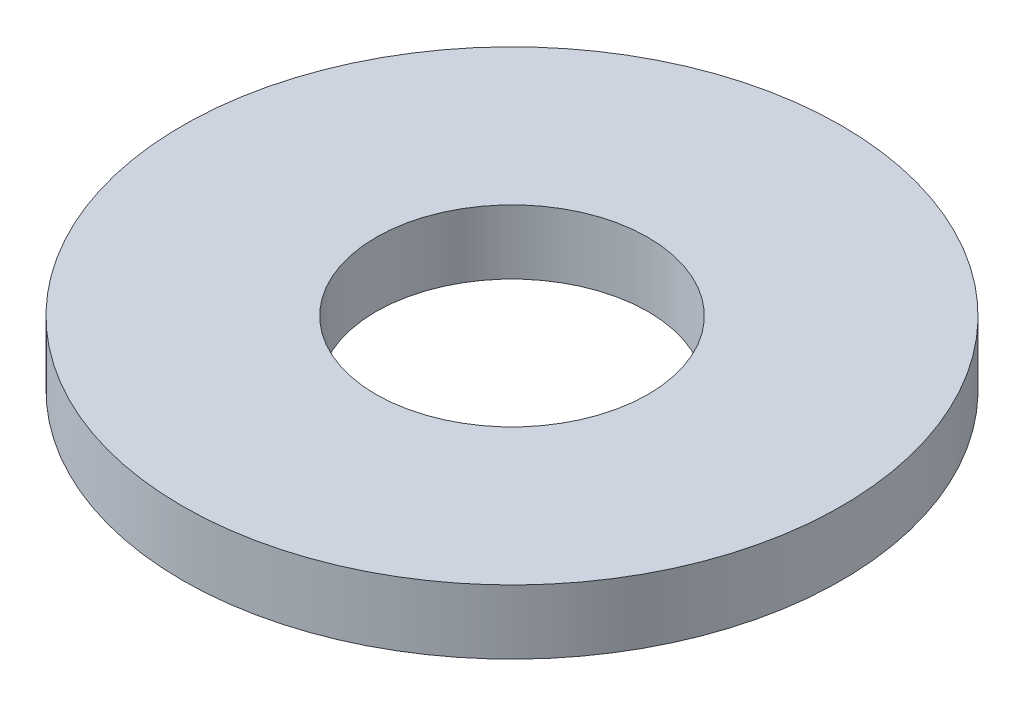
ISO-10303-21;
HEADER;
FILE_DESCRIPTION(('STEP AP214'),'2;1');
FILE_NAME('part.step','',(''),(''),'','','');
FILE_SCHEMA(('AUTOMOTIVE_DESIGN { 1 0 10303 214 1 1 1 1 }'));
ENDSEC;
DATA;
#1=APPLICATION_CONTEXT('core data for automotive mechanical design processes');
#2=APPLICATION_PROTOCOL_DEFINITION('international standard','automotive_design',2000,#1);
#3=PRODUCT_CONTEXT('',#1,'mechanical');
#4=PRODUCT('Part','Part','',(#3));
#5=PRODUCT_RELATED_PRODUCT_CATEGORY('part','',(#4));
#6=PRODUCT_DEFINITION_FORMATION('','',#4);
#7=PRODUCT_DEFINITION_CONTEXT('part definition',#1,'design');
#8=PRODUCT_DEFINITION('design','',#6,#7);
#9=PRODUCT_DEFINITION_SHAPE('','',#8);
#10=(LENGTH_UNIT() NAMED_UNIT(*) SI_UNIT(.MILLI.,.METRE.));
#11=(NAMED_UNIT(*) PLANE_ANGLE_UNIT() SI_UNIT($,.RADIAN.));
#12=(NAMED_UNIT(*) SI_UNIT($,.STERADIAN.) SOLID_ANGLE_UNIT());
#13=UNCERTAINTY_MEASURE_WITH_UNIT(LENGTH_MEASURE(1.E-05),#10,'distance_accuracy_value','');
#14=(GEOMETRIC_REPRESENTATION_CONTEXT(3) GLOBAL_UNCERTAINTY_ASSIGNED_CONTEXT((#13)) GLOBAL_UNIT_ASSIGNED_CONTEXT((#10,
#11,#12)) REPRESENTATION_CONTEXT('',''));
#15=CARTESIAN_POINT('',(0.,0.,0.));
#16=DIRECTION('',(0.,0.,1.));
#17=DIRECTION('',(1.,0.,0.));
#18=AXIS2_PLACEMENT_3D('',#15,#16,#17);
#19=CARTESIAN_POINT('',(0.,1.56,0.));
#20=DIRECTION('',(0.,1.,0.));
#21=DIRECTION('',(0.,0.,-1.));
#22=AXIS2_PLACEMENT_3D('',#19,#20,#21);
#23=PLANE('',#22);
#24=CARTESIAN_POINT('',(0.,1.56,0.));
#25=DIRECTION('',(0.,-1.,0.));
#26=DIRECTION('',(0.,0.,-1.));
#27=AXIS2_PLACEMENT_3D('',#24,#25,#26);
#28=CIRCLE('',#27,8.);
#29=CARTESIAN_POINT('',(0.,1.56,-8.));
#30=VERTEX_POINT('',#29);
#31=EDGE_CURVE('E10',#30,#30,#28,.T.);
#32=ORIENTED_EDGE('',*,*,#31,.F.);
#33=EDGE_LOOP('',(#32));
#34=FACE_BOUND('',#33,.T.);
#35=CARTESIAN_POINT('',(0.,1.56,0.));
#36=DIRECTION('',(0.,-1.,0.));
#37=DIRECTION('',(0.,0.,-1.));
#38=AXIS2_PLACEMENT_3D('',#35,#36,#37);
#39=CIRCLE('',#38,3.302);
#40=CARTESIAN_POINT('',(0.,1.56,-3.302));
#41=VERTEX_POINT('',#40);
#42=EDGE_CURVE('E41',#41,#41,#39,.T.);
#43=ORIENTED_EDGE('',*,*,#42,.T.);
#44=EDGE_LOOP('',(#43));
#45=FACE_BOUND('',#44,.T.);
#46=ADVANCED_FACE('F30',(#34,#45),#23,.T.);
#47=CARTESIAN_POINT('',(0.,0.,0.));
#48=DIRECTION('',(0.,1.,0.));
#49=DIRECTION('',(0.,0.,-1.));
#50=AXIS2_PLACEMENT_3D('',#47,#48,#49);
#51=PLANE('',#50);
#52=CARTESIAN_POINT('',(0.,0.,0.));
#53=DIRECTION('',(0.,-1.,0.));
#54=DIRECTION('',(0.,0.,-1.));
#55=AXIS2_PLACEMENT_3D('',#52,#53,#54);
#56=CIRCLE('',#55,8.);
#57=CARTESIAN_POINT('',(0.,0.,-8.));
#58=VERTEX_POINT('',#57);
#59=EDGE_CURVE('E34',#58,#58,#56,.T.);
#60=ORIENTED_EDGE('',*,*,#59,.T.);
#61=EDGE_LOOP('',(#60));
#62=FACE_BOUND('',#61,.T.);
#63=CARTESIAN_POINT('',(0.,0.,0.));
#64=DIRECTION('',(0.,-1.,0.));
#65=DIRECTION('',(0.,0.,-1.));
#66=AXIS2_PLACEMENT_3D('',#63,#64,#65);
#67=CIRCLE('',#66,3.302);
#68=CARTESIAN_POINT('',(0.,0.,-3.302));
#69=VERTEX_POINT('',#68);
#70=EDGE_CURVE('E43',#69,#69,#67,.T.);
#71=ORIENTED_EDGE('',*,*,#70,.F.);
#72=EDGE_LOOP('',(#71));
#73=FACE_BOUND('',#72,.T.);
#74=ADVANCED_FACE('F56',(#62,#73),#51,.F.);
#75=CARTESIAN_POINT('',(0.,1.56,0.));
#76=DIRECTION('',(0.,-1.,0.));
#77=DIRECTION('',(0.,0.,1.));
#78=AXIS2_PLACEMENT_3D('',#75,#76,#77);
#79=CYLINDRICAL_SURFACE('',#78,8.);
#80=ORIENTED_EDGE('',*,*,#31,.T.);
#81=EDGE_LOOP('',(#80));
#82=FACE_BOUND('',#81,.T.);
#83=ORIENTED_EDGE('',*,*,#59,.F.);
#84=EDGE_LOOP('',(#83));
#85=FACE_BOUND('',#84,.T.);
#86=ADVANCED_FACE('F32',(#82,#85),#79,.T.);
#87=CARTESIAN_POINT('',(0.,1.56,0.));
#88=DIRECTION('',(0.,-1.,0.));
#89=DIRECTION('',(0.,0.,1.));
#90=AXIS2_PLACEMENT_3D('',#87,#88,#89);
#91=CYLINDRICAL_SURFACE('',#90,3.302);
#92=ORIENTED_EDGE('',*,*,#42,.F.);
#93=EDGE_LOOP('',(#92));
#94=FACE_BOUND('',#93,.T.);
#95=ORIENTED_EDGE('',*,*,#70,.T.);
#96=EDGE_LOOP('',(#95));
#97=FACE_BOUND('',#96,.T.);
#98=ADVANCED_FACE('F50',(#94,#97),#91,.F.);
#99=CLOSED_SHELL('',(#46,#74,#86,#98));
#100=MANIFOLD_SOLID_BREP('B2',#99);
#101=ADVANCED_BREP_SHAPE_REPRESENTATION('',(#18,#100),#14);
#102=SHAPE_DEFINITION_REPRESENTATION(#9,#101);
ENDSEC;
END-ISO-10303-21;
